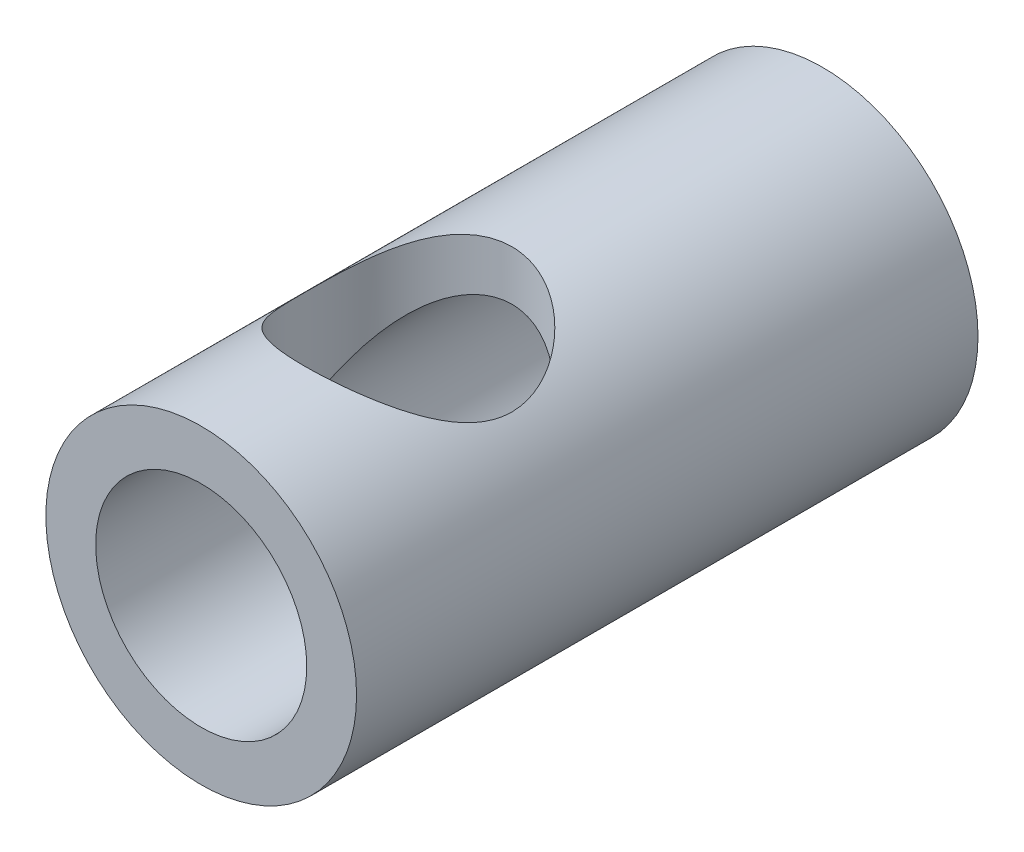
ISO-10303-21;
HEADER;
FILE_DESCRIPTION(('STEP AP214'),'2;1');
FILE_NAME('part.step','',(''),(''),'','','');
FILE_SCHEMA(('AUTOMOTIVE_DESIGN { 1 0 10303 214 1 1 1 1 }'));
ENDSEC;
DATA;
#1=APPLICATION_CONTEXT('core data for automotive mechanical design processes');
#2=APPLICATION_PROTOCOL_DEFINITION('international standard','automotive_design',2000,#1);
#3=PRODUCT_CONTEXT('',#1,'mechanical');
#4=PRODUCT('Part','Part','',(#3));
#5=PRODUCT_RELATED_PRODUCT_CATEGORY('part','',(#4));
#6=PRODUCT_DEFINITION_FORMATION('','',#4);
#7=PRODUCT_DEFINITION_CONTEXT('part definition',#1,'design');
#8=PRODUCT_DEFINITION('design','',#6,#7);
#9=PRODUCT_DEFINITION_SHAPE('','',#8);
#10=(LENGTH_UNIT() NAMED_UNIT(*) SI_UNIT(.MILLI.,.METRE.));
#11=(NAMED_UNIT(*) PLANE_ANGLE_UNIT() SI_UNIT($,.RADIAN.));
#12=(NAMED_UNIT(*) SI_UNIT($,.STERADIAN.) SOLID_ANGLE_UNIT());
#13=UNCERTAINTY_MEASURE_WITH_UNIT(LENGTH_MEASURE(1.E-05),#10,'distance_accuracy_value','');
#14=(GEOMETRIC_REPRESENTATION_CONTEXT(3) GLOBAL_UNCERTAINTY_ASSIGNED_CONTEXT((#13)) GLOBAL_UNIT_ASSIGNED_CONTEXT((#10,
#11,#12)) REPRESENTATION_CONTEXT('',''));
#15=CARTESIAN_POINT('',(0.,0.,0.));
#16=DIRECTION('',(0.,0.,1.));
#17=DIRECTION('',(1.,0.,0.));
#18=AXIS2_PLACEMENT_3D('',#15,#16,#17);
#19=CARTESIAN_POINT('',(0.,0.,12.));
#20=DIRECTION('',(0.,0.,-1.));
#21=DIRECTION('',(-1.,0.,0.));
#22=AXIS2_PLACEMENT_3D('',#19,#20,#21);
#23=CYLINDRICAL_SURFACE('',#22,3.);
#24=CARTESIAN_POINT('',(0.,0.,12.));
#25=DIRECTION('',(0.,0.,1.));
#26=DIRECTION('',(1.,0.,0.));
#27=AXIS2_PLACEMENT_3D('',#24,#25,#26);
#28=CIRCLE('',#27,3.);
#29=CARTESIAN_POINT('',(3.,0.,12.));
#30=VERTEX_POINT('',#29);
#31=EDGE_CURVE('E10',#30,#30,#28,.T.);
#32=ORIENTED_EDGE('',*,*,#31,.F.);
#33=EDGE_LOOP('',(#32));
#34=FACE_BOUND('',#33,.T.);
#35=CARTESIAN_POINT('',(0.,0.,0.));
#36=DIRECTION('',(0.,0.,1.));
#37=DIRECTION('',(1.,0.,0.));
#38=AXIS2_PLACEMENT_3D('',#35,#36,#37);
#39=CIRCLE('',#38,3.);
#40=CARTESIAN_POINT('',(3.,0.,0.));
#41=VERTEX_POINT('',#40);
#42=EDGE_CURVE('E51',#41,#41,#39,.T.);
#43=ORIENTED_EDGE('',*,*,#42,.T.);
#44=EDGE_LOOP('',(#43));
#45=FACE_BOUND('',#44,.T.);
#46=CARTESIAN_POINT('',(0.,3.,6.));
#47=CARTESIAN_POINT('',(-0.100484716668078,3.0000004164484,5.99999945036753));
#48=CARTESIAN_POINT('',(-0.200969087132901,2.99490802753388,6.0076139699555));
#49=CARTESIAN_POINT('',(-0.398733058031681,2.97504652423809,6.03759686410566));
#50=CARTESIAN_POINT('',(-0.496011113955007,2.96027281581235,6.05997224312329));
#51=CARTESIAN_POINT('',(-0.684212307854249,2.92250482404708,6.11810771732484));
#52=CARTESIAN_POINT('',(-0.775162872657554,2.89954905493315,6.15380514000794));
#53=CARTESIAN_POINT('',(-0.949415290997259,2.8472613787744,6.2370633632715));
#54=CARTESIAN_POINT('',(-1.03271603160967,2.8179285460551,6.28462588630056));
#55=CARTESIAN_POINT('',(-1.19728470077011,2.75227329369838,6.39465693736743));
#56=CARTESIAN_POINT('',(-1.27778030546067,2.71556897579319,6.45804786074289));
#57=CARTESIAN_POINT('',(-1.42772804469274,2.63982313083466,6.59573004865845));
#58=CARTESIAN_POINT('',(-1.49716405543888,2.60077830356832,6.67003692983774));
#59=CARTESIAN_POINT('',(-1.63422297745496,2.51728264678794,6.84105236761267));
#60=CARTESIAN_POINT('',(-1.6998318636275,2.47295067937795,6.93944565320345));
#61=CARTESIAN_POINT('',(-1.81350357014175,2.3908414735282,7.14836337764653));
#62=CARTESIAN_POINT('',(-1.86159673426503,2.35305295954668,7.25886640156274));
#63=CARTESIAN_POINT('',(-1.92674035011438,2.29976266641461,7.45671129342163));
#64=CARTESIAN_POINT('',(-1.94874447236008,2.28097627892403,7.54152845287391));
#65=CARTESIAN_POINT('',(-1.98150617785228,2.25257969659604,7.71474450474165));
#66=CARTESIAN_POINT('',(-1.99228314651963,2.24295368744147,7.80313694872606));
#67=CARTESIAN_POINT('',(-2.00191364141227,2.23436605608045,7.98147477885647));
#68=CARTESIAN_POINT('',(-2.00071842917524,2.23544802558502,8.0714250234524));
#69=CARTESIAN_POINT('',(-1.98637581333356,2.24819775483425,8.24963497349976));
#70=CARTESIAN_POINT('',(-1.97321828380393,2.25987448286881,8.33789318202813));
#71=CARTESIAN_POINT('',(-1.93664994217326,2.2912718598996,8.50646705124188));
#72=CARTESIAN_POINT('',(-1.91371711479477,2.31061488324375,8.58696133593877));
#73=CARTESIAN_POINT('',(-1.85870118583424,2.35509622933623,8.74302369097578));
#74=CARTESIAN_POINT('',(-1.8266150732855,2.3802364585489,8.81859013023865));
#75=CARTESIAN_POINT('',(-1.74673818732648,2.43964196377947,8.97902539535645));
#76=CARTESIAN_POINT('',(-1.69708052300445,2.47472317740627,9.0626599004831));
#77=CARTESIAN_POINT('',(-1.5866896043822,2.54691537733438,9.22138339528575));
#78=CARTESIAN_POINT('',(-1.52594268999614,2.58402882709328,9.29646165776207));
#79=CARTESIAN_POINT('',(-1.37981165322308,2.66543343763724,9.45254254560342));
#80=CARTESIAN_POINT('',(-1.29193938283656,2.7095474472056,9.53133404868277));
#81=CARTESIAN_POINT('',(-1.10200799908008,2.79218100665212,9.67319649453849));
#82=CARTESIAN_POINT('',(-0.999962299343694,2.83070577648042,9.73628214540898));
#83=CARTESIAN_POINT('',(-0.804857827096527,2.89145404090364,9.83347771862287));
#84=CARTESIAN_POINT('',(-0.713957643371907,2.9153926116554,9.87084336333894));
#85=CARTESIAN_POINT('',(-0.526036043935478,2.95507719030499,9.93210492562537));
#86=CARTESIAN_POINT('',(-0.429019879001648,2.97083012127544,9.95601222713222));
#87=CARTESIAN_POINT('',(-0.230985453172279,2.99275882156808,9.989161165238));
#88=CARTESIAN_POINT('',(-0.129951811934156,2.99889322461187,9.99833946093826));
#89=CARTESIAN_POINT('',(0.0724415193893484,3.00083114965147,10.0012470885622));
#90=CARTESIAN_POINT('',(0.173801186186627,2.99663539385634,9.99497750048877));
#91=CARTESIAN_POINT('',(0.36645571720424,2.97899589424273,9.96837594443805));
#92=CARTESIAN_POINT('',(0.457957444679194,2.96622246390226,9.94906270224478));
#93=CARTESIAN_POINT('',(0.636116392427402,2.93318449284837,9.89840431398714));
#94=CARTESIAN_POINT('',(0.722772837571135,2.91291875746989,9.86705724907179));
#95=CARTESIAN_POINT('',(0.894664750465998,2.86496352529158,9.79134770295508));
#96=CARTESIAN_POINT('',(0.979496184631421,2.83689870135785,9.74631184591814));
#97=CARTESIAN_POINT('',(1.14068302395729,2.77601855611511,9.64556671005372));
#98=CARTESIAN_POINT('',(1.21703314820091,2.74320030403941,9.58985083946783));
#99=CARTESIAN_POINT('',(1.37185445482324,2.6695454665343,9.45939213184249));
#100=CARTESIAN_POINT('',(1.44875187569565,2.62826156800165,9.38303373992491));
#101=CARTESIAN_POINT('',(1.58933968069449,2.54571173085958,9.21888857004288));
#102=CARTESIAN_POINT('',(1.6530209365723,2.50444582417845,9.13109396089249));
#103=CARTESIAN_POINT('',(1.76124776549313,2.4293967897058,8.95285758723187));
#104=CARTESIAN_POINT('',(1.80695636125283,2.39527597025701,8.86326796653779));
#105=CARTESIAN_POINT('',(1.88496213740264,2.33438974266154,8.67612734755637));
#106=CARTESIAN_POINT('',(1.91728345682189,2.30761112529822,8.57859106169537));
#107=CARTESIAN_POINT('',(1.9623584346534,2.26933208182633,8.39543551280459));
#108=CARTESIAN_POINT('',(1.97758597566225,2.25594998021257,8.31082819012399));
#109=CARTESIAN_POINT('',(1.99699205923373,2.23879466438398,8.13942671868161));
#110=CARTESIAN_POINT('',(2.00118260285317,2.23501101347816,8.0526350488605));
#111=CARTESIAN_POINT('',(1.99823921981266,2.23764201149981,7.8793569432763));
#112=CARTESIAN_POINT('',(1.99109858767783,2.24406269907463,7.79287071862624));
#113=CARTESIAN_POINT('',(1.96596997224746,2.26610452403491,7.62265647146788));
#114=CARTESIAN_POINT('',(1.94796751728258,2.28173793527615,7.53893228617567));
#115=CARTESIAN_POINT('',(1.89593035657494,2.32526843904801,7.35428881351876));
#116=CARTESIAN_POINT('',(1.85890187130765,2.35532333574983,7.25473228705667));
#117=CARTESIAN_POINT('',(1.7708452623622,2.42222161121309,7.06451316561579));
#118=CARTESIAN_POINT('',(1.71979748341259,2.459074496867,6.97386330200831));
#119=CARTESIAN_POINT('',(1.60398280555152,2.53617186577119,6.80071811286377));
#120=CARTESIAN_POINT('',(1.53898309894021,2.5764658739228,6.71840125457695));
#121=CARTESIAN_POINT('',(1.39671768031094,2.65628301537844,6.56467752174207));
#122=CARTESIAN_POINT('',(1.31944821025748,2.69580590832396,6.49327400297079));
#123=CARTESIAN_POINT('',(1.14145732976974,2.77631551964082,6.35328789569092));
#124=CARTESIAN_POINT('',(1.03896166955575,2.81669805449991,6.28658135982168));
#125=CARTESIAN_POINT('',(0.820868555771216,2.88777665874161,6.1720867233347));
#126=CARTESIAN_POINT('',(0.705292062449156,2.91848793445255,6.12426889317605));
#127=CARTESIAN_POINT('',(0.491435069835745,2.96101644836895,6.05884542183622));
#128=CARTESIAN_POINT('',(0.395012325257921,2.97551480368935,6.03688896090138));
#129=CARTESIAN_POINT('',(0.199058012023946,2.99500280141853,6.0074719674619));
#130=CARTESIAN_POINT('',(0.0995288361880077,2.99999958751315,6.00000054440399));
#131=CARTESIAN_POINT('',(0.,3.,6.));
#132=B_SPLINE_CURVE_WITH_KNOTS('',3,(#46,#47,#48,#49,#50,#51,#52,#53,#54,#55,#56,#57,#58,#59,
#60,#61,#62,#63,#64,#65,#66,#67,#68,#69,#70,#71,#72,#73,#74,#75,#76,#77,#78,#79,#80,#81,#82,#83,
#84,#85,#86,#87,#88,#89,#90,#91,#92,#93,#94,#95,#96,#97,#98,#99,#100,#101,#102,#103,#104,#105,
#106,#107,#108,#109,#110,#111,#112,#113,#114,#115,#116,#117,#118,#119,#120,#121,#122,#123,#124,
#125,#126,#127,#128,#129,#130,#131),.UNSPECIFIED.,.T.,.F.,(4,2,2,2,2,2,2,2,2,2,2,2,2,2,2,2,2,2,
2,2,2,2,2,2,2,2,2,2,2,2,2,2,2,2,2,2,2,2,2,2,2,2,4),(0.,0.3010532265054,0.602249414348688,
0.902046153190231,1.20188643867386,1.52717029000557,1.85292411604319,2.23006683295982,
2.60655305445439,2.87433693676029,3.14165767845809,3.41006711735378,3.67870397263352,
3.93548862198022,4.19235783805079,4.50147574660874,4.81097703780057,5.18718954496753,
5.56304840301363,5.86524087696758,6.16717735142814,6.47040883294251,6.77361911533415,
7.05553084792473,7.33748755138271,7.63652346829516,7.93574454945204,8.28228176141291,
8.62905753175758,8.94649935304476,9.26336626640723,9.52324048016135,9.78283200333091,
10.0425772028455,10.302669238524,10.6320660870419,10.9619271337795,11.2977924520448,
11.6337608397015,12.0179535155883,12.4015390656083,12.6999529136674,12.9981423125957),.UNSPECIFIED.);
#133=CARTESIAN_POINT('',(0.,3.,6.));
#134=VERTEX_POINT('',#133);
#135=EDGE_CURVE('E63',#134,#134,#132,.T.);
#136=ORIENTED_EDGE('',*,*,#135,.F.);
#137=EDGE_LOOP('',(#136));
#138=FACE_BOUND('',#137,.T.);
#139=ADVANCED_FACE('F37',(#34,#45,#138),#23,.T.);
#140=CARTESIAN_POINT('',(0.,0.,12.));
#141=DIRECTION('',(0.,0.,-1.));
#142=DIRECTION('',(-1.,0.,0.));
#143=AXIS2_PLACEMENT_3D('',#140,#141,#142);
#144=CYLINDRICAL_SURFACE('',#143,2.038096);
#145=CARTESIAN_POINT('',(0.,0.,0.));
#146=DIRECTION('',(0.,0.,1.));
#147=DIRECTION('',(1.,0.,0.));
#148=AXIS2_PLACEMENT_3D('',#145,#146,#147);
#149=CIRCLE('',#148,2.038096);
#150=CARTESIAN_POINT('',(2.038096,0.,0.));
#151=VERTEX_POINT('',#150);
#152=EDGE_CURVE('E59',#151,#151,#149,.T.);
#153=ORIENTED_EDGE('',*,*,#152,.F.);
#154=EDGE_LOOP('',(#153));
#155=FACE_BOUND('',#154,.T.);
#156=CARTESIAN_POINT('',(0.,0.,12.));
#157=DIRECTION('',(0.,0.,1.));
#158=DIRECTION('',(1.,0.,0.));
#159=AXIS2_PLACEMENT_3D('',#156,#157,#158);
#160=CIRCLE('',#159,2.038096);
#161=CARTESIAN_POINT('',(2.038096,0.,12.));
#162=VERTEX_POINT('',#161);
#163=EDGE_CURVE('E57',#162,#162,#160,.T.);
#164=ORIENTED_EDGE('',*,*,#163,.T.);
#165=EDGE_LOOP('',(#164));
#166=FACE_BOUND('',#165,.T.);
#167=CARTESIAN_POINT('',(0.,2.038096,6.));
#168=CARTESIAN_POINT('',(-0.0898996066187428,2.03809596120029,6.00000003783215));
#169=CARTESIAN_POINT('',(-0.179799927996391,2.03210139957117,6.00610775752113));
#170=CARTESIAN_POINT('',(-0.356493486332543,2.00865726798054,6.03000659983464));
#171=CARTESIAN_POINT('',(-0.443285023610263,1.99120152964048,6.04780401382717));
#172=CARTESIAN_POINT('',(-0.610730214509612,1.94636031403181,6.0935625424345));
#173=CARTESIAN_POINT('',(-0.691419494152308,1.91903889724848,6.12145809002236));
#174=CARTESIAN_POINT('',(-0.845842803962725,1.85616518435712,6.18573476133966));
#175=CARTESIAN_POINT('',(-0.919574175075906,1.82060975930215,6.22211911087768));
#176=CARTESIAN_POINT('',(-1.08808534578119,1.72702554506462,6.31805594061164));
#177=CARTESIAN_POINT('',(-1.17912931273751,1.66575471422076,6.38099596318631));
#178=CARTESIAN_POINT('',(-1.34606201061705,1.53405000046962,6.51684204482976));
#179=CARTESIAN_POINT('',(-1.42190820740344,1.46359128742822,6.58977513817033));
#180=CARTESIAN_POINT('',(-1.53749886052724,1.33966344076341,6.71895313248561));
#181=CARTESIAN_POINT('',(-1.58112309842457,1.28775418740446,6.77330312466556));
#182=CARTESIAN_POINT('',(-1.66171787207574,1.18192669540639,6.88490644033737));
#183=CARTESIAN_POINT('',(-1.69868819899131,1.12800839377577,6.94215985488317));
#184=CARTESIAN_POINT('',(-1.76616822374059,1.01910855676311,7.05914807732793));
#185=CARTESIAN_POINT('',(-1.79668914743272,0.964129053687934,7.11887835347867));
#186=CARTESIAN_POINT('',(-1.85157986377849,0.853967326098984,7.240959084492));
#187=CARTESIAN_POINT('',(-1.87594864622106,0.798785069799496,7.30330996771262));
#188=CARTESIAN_POINT('',(-1.91120519852787,0.708933322125345,7.40904773423475));
#189=CARTESIAN_POINT('',(-1.92383260192857,0.673811273237143,7.45147892580726));
#190=CARTESIAN_POINT('',(-1.94649394327029,0.605217141869926,7.53828723123922));
#191=CARTESIAN_POINT('',(-1.95653115315829,0.571743021427348,7.5826618064525));
#192=CARTESIAN_POINT('',(-1.97168117945765,0.516630463990438,7.66282525546051));
#193=CARTESIAN_POINT('',(-1.97739702031518,0.494151286314128,7.69791613900422));
#194=CARTESIAN_POINT('',(-1.98714866081066,0.453328959880785,7.77069175916202));
#195=CARTESIAN_POINT('',(-1.99119001939403,0.434972219950514,7.80836742125657));
#196=CARTESIAN_POINT('',(-1.99591763655148,0.412580239153841,7.87029426612297));
#197=CARTESIAN_POINT('',(-1.99729985550559,0.40577383357518,7.89344879451322));
#198=CARTESIAN_POINT('',(-1.99925438829766,0.396033743590692,7.9405566314885));
#199=CARTESIAN_POINT('',(-1.99982955084472,0.39308643998757,7.96450682347194));
#200=CARTESIAN_POINT('',(-2.0001054475779,0.391681829268128,8.01268929246272));
#201=CARTESIAN_POINT('',(-1.99980121944058,0.393250002393795,8.0369223987448));
#202=CARTESIAN_POINT('',(-1.99834797259264,0.400566255941614,8.08474541371539));
#203=CARTESIAN_POINT('',(-1.99719662031845,0.406325882033699,8.10833335865487));
#204=CARTESIAN_POINT('',(-1.99324654349428,0.425371262190911,8.16836520855333));
#205=CARTESIAN_POINT('',(-1.98987269415569,0.441101911155877,8.20396006643156));
#206=CARTESIAN_POINT('',(-1.98161477850234,0.476846097747949,8.27278652133678));
#207=CARTESIAN_POINT('',(-1.9767226393959,0.49688234892392,8.3060042889714));
#208=CARTESIAN_POINT('',(-1.96089102420596,0.557093122711565,8.39826211692231));
#209=CARTESIAN_POINT('',(-1.94834486819663,0.599915207991423,8.45526498999769));
#210=CARTESIAN_POINT('',(-1.91902218476022,0.688034129212797,8.56623976701782));
#211=CARTESIAN_POINT('',(-1.90223606245454,0.733336393091394,8.62020445231651));
#212=CARTESIAN_POINT('',(-1.8644009486669,0.824799300681185,8.72606655699043));
#213=CARTESIAN_POINT('',(-1.84334431285252,0.870961346923222,8.77796006668673));
#214=CARTESIAN_POINT('',(-1.79693374924897,0.963082502627581,8.87986249275493));
#215=CARTESIAN_POINT('',(-1.77158407669502,1.00904176724598,8.92987321591335));
#216=CARTESIAN_POINT('',(-1.71652858196554,1.10008396093731,9.02794958593227));
#217=CARTESIAN_POINT('',(-1.68683662193879,1.14516917995001,9.07602082335813));
#218=CARTESIAN_POINT('',(-1.62289826093019,1.23411563555172,9.17023272645962));
#219=CARTESIAN_POINT('',(-1.58865035167182,1.27797646095429,9.21637274611407));
#220=CARTESIAN_POINT('',(-1.47896907231265,1.40683267857133,9.3513200304182));
#221=CARTESIAN_POINT('',(-1.39643042763283,1.48938847848653,9.43695982674748));
#222=CARTESIAN_POINT('',(-1.23462460031316,1.62409646932688,9.57609172212562));
#223=CARTESIAN_POINT('',(-1.15969239278671,1.67869149053259,9.63226989269065));
#224=CARTESIAN_POINT('',(-0.998522322912102,1.7792631826258,9.735534925934));
#225=CARTESIAN_POINT('',(-0.912296203087157,1.82524868600481,9.7826311073166));
#226=CARTESIAN_POINT('',(-0.745364604426271,1.89870164254222,9.85776276990645));
#227=CARTESIAN_POINT('',(-0.666325874435581,1.92800067511668,9.88769073081947));
#228=CARTESIAN_POINT('',(-0.502372732479233,1.97705819924127,9.93776918789574));
#229=CARTESIAN_POINT('',(-0.41746247210455,1.9968233546305,9.95792651343197));
#230=CARTESIAN_POINT('',(-0.243379363065695,2.02544335291532,9.98710685097763));
#231=CARTESIAN_POINT('',(-0.154184291181496,2.03423303549862,9.99606336533597));
#232=CARTESIAN_POINT('',(0.0249738627497052,2.03991054206027,10.0018491736896));
#233=CARTESIAN_POINT('',(0.114936731267551,2.03680157400303,9.99868173639208));
#234=CARTESIAN_POINT('',(0.283819681268935,2.01984798527427,9.98140174308172));
#235=CARTESIAN_POINT('',(0.362965794174147,2.00707159493434,9.96837823939675));
#236=CARTESIAN_POINT('',(0.517346866266116,1.97292725465397,9.93355072221233));
#237=CARTESIAN_POINT('',(0.59258104373344,1.95155759492075,9.91174496131606));
#238=CARTESIAN_POINT('',(0.742201530899459,1.89989916630806,9.85898150411744));
#239=CARTESIAN_POINT('',(0.816256142511622,1.86914582826963,9.82754665841741));
#240=CARTESIAN_POINT('',(0.957550811223898,1.80086100038669,9.75764634984696));
#241=CARTESIAN_POINT('',(1.02478801634739,1.76332669192417,9.71917796329312));
#242=CARTESIAN_POINT('',(1.18799436780344,1.66022845817768,9.61330130178189));
#243=CARTESIAN_POINT('',(1.27885165623841,1.59077375225529,9.54178576447851));
#244=CARTESIAN_POINT('',(1.44362569447919,1.4429465032685,9.38876323784131));
#245=CARTESIAN_POINT('',(1.51748259934735,1.36454386732271,9.30722245697022));
#246=CARTESIAN_POINT('',(1.62748035298318,1.22885408941091,9.16470984322826));
#247=CARTESIAN_POINT('',(1.66806613202251,1.17301931375149,9.10570237970879));
#248=CARTESIAN_POINT('',(1.74219909583577,1.05978885212659,8.98477390422515));
#249=CARTESIAN_POINT('',(1.77574357075464,1.00239257477921,8.9228517817333));
#250=CARTESIAN_POINT('',(1.83593741997605,0.887343290378896,8.79638074278134));
#251=CARTESIAN_POINT('',(1.86260684362955,0.829691540234133,8.73184011456459));
#252=CARTESIAN_POINT('',(1.90937653970926,0.715456525958861,8.59937789156546));
#253=CARTESIAN_POINT('',(1.92947475595948,0.658873601479664,8.53145524617276));
#254=CARTESIAN_POINT('',(1.95432730628818,0.578963405709267,8.42641642533951));
#255=CARTESIAN_POINT('',(1.96164650447775,0.553547852124735,8.39149844304841));
#256=CARTESIAN_POINT('',(1.9746226667251,0.505284663112643,8.31968717594233));
#257=CARTESIAN_POINT('',(1.98028404191948,0.482430314847179,8.28279944761731));
#258=CARTESIAN_POINT('',(1.9881093853943,0.448828202632995,8.21923015931938));
#259=CARTESIAN_POINT('',(1.99080643447415,0.436621016793902,8.19340597105568));
#260=CARTESIAN_POINT('',(1.9952528253278,0.415830035405407,8.14025793266509));
#261=CARTESIAN_POINT('',(1.99700493118815,0.407235688260335,8.11293871677725));
#262=CARTESIAN_POINT('',(1.99913626361829,0.396628393027603,8.06281533939918));
#263=CARTESIAN_POINT('',(1.99972384798114,0.393624867408144,8.04023932988395));
#264=CARTESIAN_POINT('',(2.00012155433013,0.391599926696683,7.99492827850181));
#265=CARTESIAN_POINT('',(1.99993294444543,0.392572016315535,7.97219355656793));
#266=CARTESIAN_POINT('',(1.99867901465092,0.398909937411956,7.9223226308487));
#267=CARTESIAN_POINT('',(1.99743080554399,0.405191054272646,7.89531243222858));
#268=CARTESIAN_POINT('',(1.99397380579789,0.421870266772754,7.84260113805952));
#269=CARTESIAN_POINT('',(1.99175999344573,0.432289859282511,7.81690768173599));
#270=CARTESIAN_POINT('',(1.98544668860054,0.4605653361199,7.75655231079133));
#271=CARTESIAN_POINT('',(1.98094606180806,0.479716017354596,7.72255979602618));
#272=CARTESIAN_POINT('',(1.97055866627451,0.520759692962183,7.65646486645615));
#273=CARTESIAN_POINT('',(1.96466831688711,0.542659701662131,7.6243676064725));
#274=CARTESIAN_POINT('',(1.94499539148346,0.61077631611446,7.5296986958481));
#275=CARTESIAN_POINT('',(1.92925516654529,0.659188854087542,7.46913107984058));
#276=CARTESIAN_POINT('',(1.88997472535677,0.765205859246871,7.34193447324586));
#277=CARTESIAN_POINT('',(1.86560824884341,0.823080891016122,7.27580148178256));
#278=CARTESIAN_POINT('',(1.81006688651952,0.938950189755947,7.14641136792594));
#279=CARTESIAN_POINT('',(1.77888479749088,0.996944518080206,7.08315737436871));
#280=CARTESIAN_POINT('',(1.70962291633987,1.11152772049654,6.95972381579599));
#281=CARTESIAN_POINT('',(1.67157066171702,1.16812121538021,6.89953316402255));
#282=CARTESIAN_POINT('',(1.58822608276952,1.27913570007647,6.7823371597279));
#283=CARTESIAN_POINT('',(1.542939280603,1.33355830765441,6.72532942210934));
#284=CARTESIAN_POINT('',(1.42834521171469,1.45703199692603,6.59659650036313));
#285=CARTESIAN_POINT('',(1.356068499881,1.52489302951767,6.52632039644472));
#286=CARTESIAN_POINT('',(1.19739804248,1.65239353098438,6.39474980964706));
#287=CARTESIAN_POINT('',(1.11102043135512,1.71204225436489,6.33344521173095));
#288=CARTESIAN_POINT('',(0.94361353865365,1.80851467889072,6.23450192270587));
#289=CARTESIAN_POINT('',(0.865191708312102,1.84750643966151,6.1945919935843));
#290=CARTESIAN_POINT('',(0.700269605703176,1.91609185660844,6.12446642649828));
#291=CARTESIAN_POINT('',(0.613776853904116,1.94569415090555,6.09424187791315));
#292=CARTESIAN_POINT('',(0.440582845678903,1.99178062594944,6.04721351048297));
#293=CARTESIAN_POINT('',(0.354298073527533,2.00902174873212,6.02963500605378));
#294=CARTESIAN_POINT('',(0.178674602546818,2.03217626224531,6.00603148843775));
#295=CARTESIAN_POINT('',(0.0893376541989476,2.03809603855718,5.99999996240433));
#296=CARTESIAN_POINT('',(0.,2.038096,6.));
#297=B_SPLINE_CURVE_WITH_KNOTS('',3,(#167,#168,#169,#170,#171,#172,#173,#174,#175,#176,#177,
#178,#179,#180,#181,#182,#183,#184,#185,#186,#187,#188,#189,#190,#191,#192,#193,#194,#195,#196,
#197,#198,#199,#200,#201,#202,#203,#204,#205,#206,#207,#208,#209,#210,#211,#212,#213,#214,#215,
#216,#217,#218,#219,#220,#221,#222,#223,#224,#225,#226,#227,#228,#229,#230,#231,#232,#233,#234,
#235,#236,#237,#238,#239,#240,#241,#242,#243,#244,#245,#246,#247,#248,#249,#250,#251,#252,#253,
#254,#255,#256,#257,#258,#259,#260,#261,#262,#263,#264,#265,#266,#267,#268,#269,#270,#271,#272,
#273,#274,#275,#276,#277,#278,#279,#280,#281,#282,#283,#284,#285,#286,#287,#288,#289,#290,#291,
#292,#293,#294,#295,#296),.UNSPECIFIED.,.T.,.F.,(4,2,2,2,2,2,2,2,2,2,2,2,2,2,2,2,2,2,2,2,2,2,2,
2,2,2,2,2,2,2,2,2,2,2,2,2,2,2,2,2,2,2,2,2,2,2,2,2,2,2,2,2,2,2,2,2,2,2,2,2,2,2,2,2,4),(0.,
0.269313226956898,0.538771516603653,0.806510709457847,1.07435181141299,1.45181343905393,
1.83031715365792,2.09070111068617,2.35109323864712,2.61102832397061,2.87100606415984,
3.04046664159163,3.20971209588173,3.33577722639963,3.46142042624444,3.53368627054264,
3.60569638710434,3.67811364223111,3.75073113480602,3.86725036243469,3.98440005902265,
4.20107460074272,4.41824393154043,4.63580548776725,4.85315264693006,5.06982051794799,
5.28656029760916,5.71869836565068,6.04286818093723,6.36670358640555,6.63397052836021,
6.90105038860694,7.16970845131016,7.43829408691127,7.68088330091245,7.92352080650802,
8.18095996895409,8.43850638731769,8.84091883865467,9.24472691149684,9.51684378671158,
9.78906519523053,10.0604835211281,10.3319866945878,10.4633284736936,10.594317535079,
10.6802192006544,10.765868210308,10.8338870661024,10.901794838336,10.9845689073323,
11.0677786814934,11.1852919730547,11.3031114115696,11.540068065346,11.8133845316696,
12.0869912669172,12.3595247226167,12.631851137804,12.9951945967771,13.3581251902335,
13.6457698995833,13.9331492088301,14.2009300699153,14.468559849911),.UNSPECIFIED.);
#298=CARTESIAN_POINT('',(0.,2.038096,6.));
#299=VERTEX_POINT('',#298);
#300=EDGE_CURVE('E41',#299,#299,#297,.T.);
#301=ORIENTED_EDGE('',*,*,#300,.T.);
#302=EDGE_LOOP('',(#301));
#303=FACE_BOUND('',#302,.T.);
#304=ADVANCED_FACE('F77',(#155,#166,#303),#144,.F.);
#305=CARTESIAN_POINT('',(0.,0.,12.));
#306=DIRECTION('',(0.,0.,1.));
#307=DIRECTION('',(1.,0.,0.));
#308=AXIS2_PLACEMENT_3D('',#305,#306,#307);
#309=PLANE('',#308);
#310=ORIENTED_EDGE('',*,*,#31,.T.);
#311=EDGE_LOOP('',(#310));
#312=FACE_BOUND('',#311,.T.);
#313=ORIENTED_EDGE('',*,*,#163,.F.);
#314=EDGE_LOOP('',(#313));
#315=FACE_BOUND('',#314,.T.);
#316=ADVANCED_FACE('F82',(#312,#315),#309,.T.);
#317=CARTESIAN_POINT('',(0.,0.,0.));
#318=DIRECTION('',(0.,0.,1.));
#319=DIRECTION('',(1.,0.,0.));
#320=AXIS2_PLACEMENT_3D('',#317,#318,#319);
#321=PLANE('',#320);
#322=ORIENTED_EDGE('',*,*,#42,.F.);
#323=EDGE_LOOP('',(#322));
#324=FACE_BOUND('',#323,.T.);
#325=ORIENTED_EDGE('',*,*,#152,.T.);
#326=EDGE_LOOP('',(#325));
#327=FACE_BOUND('',#326,.T.);
#328=ADVANCED_FACE('F75',(#324,#327),#321,.F.);
#329=CARTESIAN_POINT('',(0.,3.,8.));
#330=DIRECTION('',(0.,-1.,0.));
#331=DIRECTION('',(0.,0.,-1.));
#332=AXIS2_PLACEMENT_3D('',#329,#330,#331);
#333=CYLINDRICAL_SURFACE('',#332,2.);
#334=ORIENTED_EDGE('',*,*,#300,.F.);
#335=EDGE_LOOP('',(#334));
#336=FACE_BOUND('',#335,.T.);
#337=ORIENTED_EDGE('',*,*,#135,.T.);
#338=EDGE_LOOP('',(#337));
#339=FACE_BOUND('',#338,.T.);
#340=ADVANCED_FACE('F72',(#336,#339),#333,.F.);
#341=CLOSED_SHELL('',(#139,#304,#316,#328,#340));
#342=MANIFOLD_SOLID_BREP('B2',#341);
#343=ADVANCED_BREP_SHAPE_REPRESENTATION('',(#18,#342),#14);
#344=SHAPE_DEFINITION_REPRESENTATION(#9,#343);
ENDSEC;
END-ISO-10303-21;
